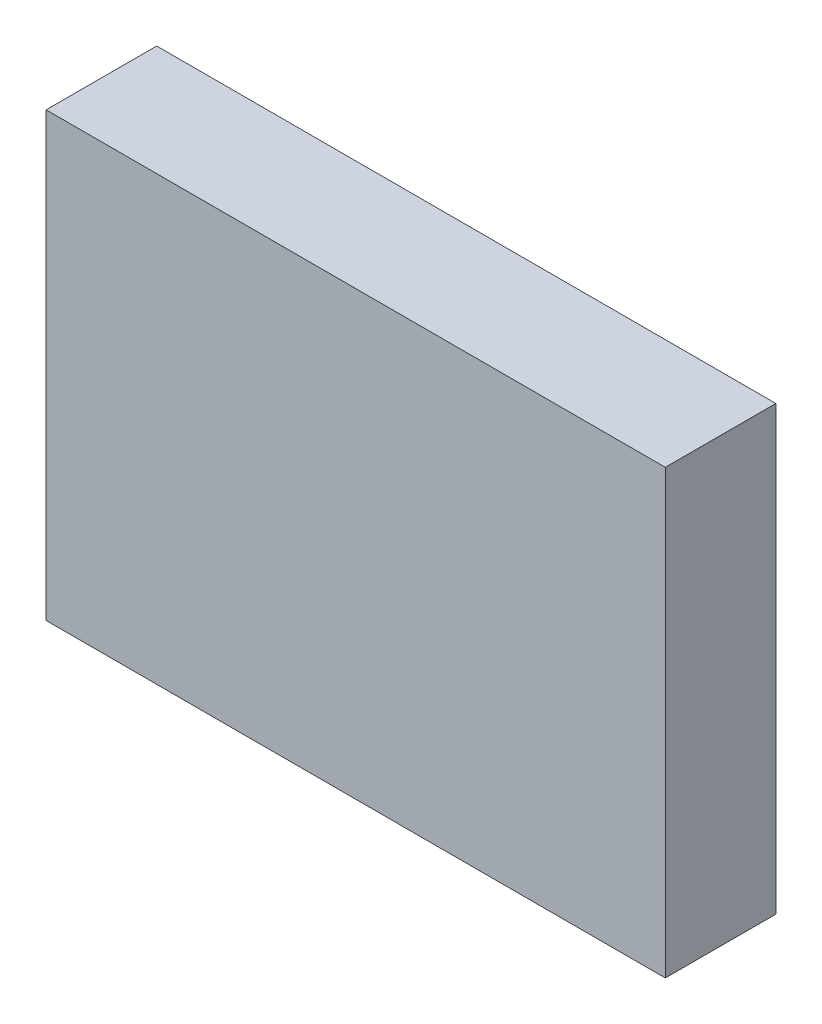
ISO-10303-21;
HEADER;
FILE_DESCRIPTION(('STEP AP214'),'2;1');
FILE_NAME('part.step','',(''),(''),'','','');
FILE_SCHEMA(('AUTOMOTIVE_DESIGN { 1 0 10303 214 1 1 1 1 }'));
ENDSEC;
DATA;
#1=APPLICATION_CONTEXT('core data for automotive mechanical design processes');
#2=APPLICATION_PROTOCOL_DEFINITION('international standard','automotive_design',2000,#1);
#3=PRODUCT_CONTEXT('',#1,'mechanical');
#4=PRODUCT('Part','Part','',(#3));
#5=PRODUCT_RELATED_PRODUCT_CATEGORY('part','',(#4));
#6=PRODUCT_DEFINITION_FORMATION('','',#4);
#7=PRODUCT_DEFINITION_CONTEXT('part definition',#1,'design');
#8=PRODUCT_DEFINITION('design','',#6,#7);
#9=PRODUCT_DEFINITION_SHAPE('','',#8);
#10=(LENGTH_UNIT() NAMED_UNIT(*) SI_UNIT(.MILLI.,.METRE.));
#11=(NAMED_UNIT(*) PLANE_ANGLE_UNIT() SI_UNIT($,.RADIAN.));
#12=(NAMED_UNIT(*) SI_UNIT($,.STERADIAN.) SOLID_ANGLE_UNIT());
#13=UNCERTAINTY_MEASURE_WITH_UNIT(LENGTH_MEASURE(1.E-05),#10,'distance_accuracy_value','');
#14=(GEOMETRIC_REPRESENTATION_CONTEXT(3) GLOBAL_UNCERTAINTY_ASSIGNED_CONTEXT((#13)) GLOBAL_UNIT_ASSIGNED_CONTEXT((#10,
#11,#12)) REPRESENTATION_CONTEXT('',''));
#15=CARTESIAN_POINT('',(0.,0.,0.));
#16=DIRECTION('',(0.,0.,1.));
#17=DIRECTION('',(1.,0.,0.));
#18=AXIS2_PLACEMENT_3D('',#15,#16,#17);
#19=CARTESIAN_POINT('',(14.,10.,5.));
#20=DIRECTION('',(-1.,0.,0.));
#21=DIRECTION('',(0.,0.,1.));
#22=AXIS2_PLACEMENT_3D('',#19,#20,#21);
#23=PLANE('',#22);
#24=DIRECTION('',(0.,1.,0.));
#25=VECTOR('',#24,1.);
#26=CARTESIAN_POINT('',(14.,10.,0.));
#27=LINE('',#26,#25);
#28=CARTESIAN_POINT('',(14.,-10.,0.));
#29=VERTEX_POINT('',#28);
#30=CARTESIAN_POINT('',(14.,10.,0.));
#31=VERTEX_POINT('',#30);
#32=EDGE_CURVE('E106',#29,#31,#27,.T.);
#33=ORIENTED_EDGE('',*,*,#32,.T.);
#34=DIRECTION('',(0.,0.,-1.));
#35=VECTOR('',#34,1.);
#36=CARTESIAN_POINT('',(14.,10.,5.));
#37=LINE('',#36,#35);
#38=CARTESIAN_POINT('',(14.,10.,5.));
#39=VERTEX_POINT('',#38);
#40=EDGE_CURVE('E11',#39,#31,#37,.T.);
#41=ORIENTED_EDGE('',*,*,#40,.F.);
#42=DIRECTION('',(0.,1.,0.));
#43=VECTOR('',#42,1.);
#44=CARTESIAN_POINT('',(14.,10.,5.));
#45=LINE('',#44,#43);
#46=CARTESIAN_POINT('',(14.,-10.,5.));
#47=VERTEX_POINT('',#46);
#48=EDGE_CURVE('E94',#47,#39,#45,.T.);
#49=ORIENTED_EDGE('',*,*,#48,.F.);
#50=DIRECTION('',(0.,0.,-1.));
#51=VECTOR('',#50,1.);
#52=CARTESIAN_POINT('',(14.,-10.,5.));
#53=LINE('',#52,#51);
#54=EDGE_CURVE('E102',#47,#29,#53,.T.);
#55=ORIENTED_EDGE('',*,*,#54,.T.);
#56=EDGE_LOOP('',(#33,#41,#49,#55));
#57=FACE_BOUND('',#56,.T.);
#58=ADVANCED_FACE('F43',(#57),#23,.F.);
#59=CARTESIAN_POINT('',(-14.,10.,5.));
#60=DIRECTION('',(0.,-1.,0.));
#61=DIRECTION('',(0.,0.,-1.));
#62=AXIS2_PLACEMENT_3D('',#59,#60,#61);
#63=PLANE('',#62);
#64=DIRECTION('',(-1.,0.,0.));
#65=VECTOR('',#64,1.);
#66=CARTESIAN_POINT('',(-14.,10.,0.));
#67=LINE('',#66,#65);
#68=CARTESIAN_POINT('',(-14.,10.,0.));
#69=VERTEX_POINT('',#68);
#70=EDGE_CURVE('E98',#31,#69,#67,.T.);
#71=ORIENTED_EDGE('',*,*,#70,.T.);
#72=DIRECTION('',(0.,0.,-1.));
#73=VECTOR('',#72,1.);
#74=CARTESIAN_POINT('',(-14.,10.,5.));
#75=LINE('',#74,#73);
#76=CARTESIAN_POINT('',(-14.,10.,5.));
#77=VERTEX_POINT('',#76);
#78=EDGE_CURVE('E51',#77,#69,#75,.T.);
#79=ORIENTED_EDGE('',*,*,#78,.F.);
#80=DIRECTION('',(-1.,0.,0.));
#81=VECTOR('',#80,1.);
#82=CARTESIAN_POINT('',(-14.,10.,5.));
#83=LINE('',#82,#81);
#84=EDGE_CURVE('E89',#39,#77,#83,.T.);
#85=ORIENTED_EDGE('',*,*,#84,.F.);
#86=ORIENTED_EDGE('',*,*,#40,.T.);
#87=EDGE_LOOP('',(#71,#79,#85,#86));
#88=FACE_BOUND('',#87,.T.);
#89=ADVANCED_FACE('F97',(#88),#63,.F.);
#90=CARTESIAN_POINT('',(-14.,10.,5.));
#91=DIRECTION('',(1.,0.,0.));
#92=DIRECTION('',(0.,1.,0.));
#93=AXIS2_PLACEMENT_3D('',#90,#91,#92);
#94=PLANE('',#93);
#95=DIRECTION('',(0.,-1.,0.));
#96=VECTOR('',#95,1.);
#97=CARTESIAN_POINT('',(-14.,10.,0.));
#98=LINE('',#97,#96);
#99=CARTESIAN_POINT('',(-14.,-10.,0.));
#100=VERTEX_POINT('',#99);
#101=EDGE_CURVE('E76',#69,#100,#98,.T.);
#102=ORIENTED_EDGE('',*,*,#101,.T.);
#103=DIRECTION('',(0.,0.,-1.));
#104=VECTOR('',#103,1.);
#105=CARTESIAN_POINT('',(-14.,-10.,5.));
#106=LINE('',#105,#104);
#107=CARTESIAN_POINT('',(-14.,-10.,5.));
#108=VERTEX_POINT('',#107);
#109=EDGE_CURVE('E99',#108,#100,#106,.T.);
#110=ORIENTED_EDGE('',*,*,#109,.F.);
#111=DIRECTION('',(0.,-1.,0.));
#112=VECTOR('',#111,1.);
#113=CARTESIAN_POINT('',(-14.,10.,5.));
#114=LINE('',#113,#112);
#115=EDGE_CURVE('E92',#77,#108,#114,.T.);
#116=ORIENTED_EDGE('',*,*,#115,.F.);
#117=ORIENTED_EDGE('',*,*,#78,.T.);
#118=EDGE_LOOP('',(#102,#110,#116,#117));
#119=FACE_BOUND('',#118,.T.);
#120=ADVANCED_FACE('F100',(#119),#94,.F.);
#121=CARTESIAN_POINT('',(-14.,-10.,5.));
#122=DIRECTION('',(0.,1.,0.));
#123=DIRECTION('',(0.,0.,1.));
#124=AXIS2_PLACEMENT_3D('',#121,#122,#123);
#125=PLANE('',#124);
#126=DIRECTION('',(1.,0.,0.));
#127=VECTOR('',#126,1.);
#128=CARTESIAN_POINT('',(-14.,-10.,0.));
#129=LINE('',#128,#127);
#130=EDGE_CURVE('E82',#100,#29,#129,.T.);
#131=ORIENTED_EDGE('',*,*,#130,.T.);
#132=ORIENTED_EDGE('',*,*,#54,.F.);
#133=DIRECTION('',(1.,0.,0.));
#134=VECTOR('',#133,1.);
#135=CARTESIAN_POINT('',(-14.,-10.,5.));
#136=LINE('',#135,#134);
#137=EDGE_CURVE('E59',#108,#47,#136,.T.);
#138=ORIENTED_EDGE('',*,*,#137,.F.);
#139=ORIENTED_EDGE('',*,*,#109,.T.);
#140=EDGE_LOOP('',(#131,#132,#138,#139));
#141=FACE_BOUND('',#140,.T.);
#142=ADVANCED_FACE('F113',(#141),#125,.F.);
#143=CARTESIAN_POINT('',(0.,0.,5.));
#144=DIRECTION('',(0.,0.,1.));
#145=DIRECTION('',(1.,0.,0.));
#146=AXIS2_PLACEMENT_3D('',#143,#144,#145);
#147=PLANE('',#146);
#148=ORIENTED_EDGE('',*,*,#48,.T.);
#149=ORIENTED_EDGE('',*,*,#84,.T.);
#150=ORIENTED_EDGE('',*,*,#115,.T.);
#151=ORIENTED_EDGE('',*,*,#137,.T.);
#152=EDGE_LOOP('',(#148,#149,#150,#151));
#153=FACE_BOUND('',#152,.T.);
#154=ADVANCED_FACE('F90',(#153),#147,.T.);
#155=CARTESIAN_POINT('',(0.,0.,0.));
#156=DIRECTION('',(0.,0.,1.));
#157=DIRECTION('',(1.,0.,0.));
#158=AXIS2_PLACEMENT_3D('',#155,#156,#157);
#159=PLANE('',#158);
#160=ORIENTED_EDGE('',*,*,#32,.F.);
#161=ORIENTED_EDGE('',*,*,#130,.F.);
#162=ORIENTED_EDGE('',*,*,#101,.F.);
#163=ORIENTED_EDGE('',*,*,#70,.F.);
#164=EDGE_LOOP('',(#160,#161,#162,#163));
#165=FACE_BOUND('',#164,.T.);
#166=ADVANCED_FACE('F116',(#165),#159,.F.);
#167=CLOSED_SHELL('',(#58,#89,#120,#142,#154,#166));
#168=MANIFOLD_SOLID_BREP('B2',#167);
#169=ADVANCED_BREP_SHAPE_REPRESENTATION('',(#18,#168),#14);
#170=SHAPE_DEFINITION_REPRESENTATION(#9,#169);
ENDSEC;
END-ISO-10303-21;
